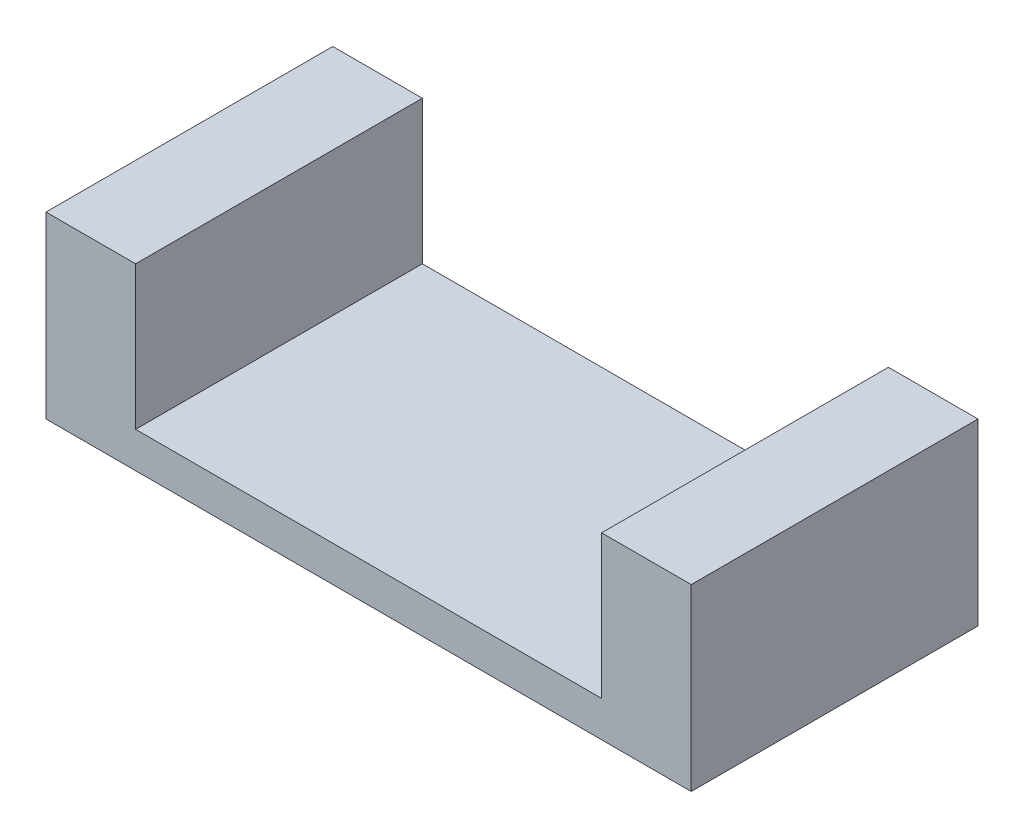
ISO-10303-21;
HEADER;
FILE_DESCRIPTION(('STEP AP214'),'2;1');
FILE_NAME('part.step','',(''),(''),'','','');
FILE_SCHEMA(('AUTOMOTIVE_DESIGN { 1 0 10303 214 1 1 1 1 }'));
ENDSEC;
DATA;
#1=APPLICATION_CONTEXT('core data for automotive mechanical design processes');
#2=APPLICATION_PROTOCOL_DEFINITION('international standard','automotive_design',2000,#1);
#3=PRODUCT_CONTEXT('',#1,'mechanical');
#4=PRODUCT('Part','Part','',(#3));
#5=PRODUCT_RELATED_PRODUCT_CATEGORY('part','',(#4));
#6=PRODUCT_DEFINITION_FORMATION('','',#4);
#7=PRODUCT_DEFINITION_CONTEXT('part definition',#1,'design');
#8=PRODUCT_DEFINITION('design','',#6,#7);
#9=PRODUCT_DEFINITION_SHAPE('','',#8);
#10=(LENGTH_UNIT() NAMED_UNIT(*) SI_UNIT(.MILLI.,.METRE.));
#11=(NAMED_UNIT(*) PLANE_ANGLE_UNIT() SI_UNIT($,.RADIAN.));
#12=(NAMED_UNIT(*) SI_UNIT($,.STERADIAN.) SOLID_ANGLE_UNIT());
#13=UNCERTAINTY_MEASURE_WITH_UNIT(LENGTH_MEASURE(1.E-05),#10,'distance_accuracy_value','');
#14=(GEOMETRIC_REPRESENTATION_CONTEXT(3) GLOBAL_UNCERTAINTY_ASSIGNED_CONTEXT((#13)) GLOBAL_UNIT_ASSIGNED_CONTEXT((#10,
#11,#12)) REPRESENTATION_CONTEXT('',''));
#15=CARTESIAN_POINT('',(0.,0.,0.));
#16=DIRECTION('',(0.,0.,1.));
#17=DIRECTION('',(1.,0.,0.));
#18=AXIS2_PLACEMENT_3D('',#15,#16,#17);
#19=CARTESIAN_POINT('',(0.,0.,0.8));
#20=DIRECTION('',(-1.,0.,0.));
#21=DIRECTION('',(0.,0.,1.));
#22=AXIS2_PLACEMENT_3D('',#19,#20,#21);
#23=PLANE('',#22);
#24=DIRECTION('',(0.,1.,0.));
#25=VECTOR('',#24,1.);
#26=CARTESIAN_POINT('',(0.,0.,0.));
#27=LINE('',#26,#25);
#28=CARTESIAN_POINT('',(0.,0.,0.));
#29=VERTEX_POINT('',#28);
#30=CARTESIAN_POINT('',(0.,0.5,0.));
#31=VERTEX_POINT('',#30);
#32=EDGE_CURVE('E140',#29,#31,#27,.T.);
#33=ORIENTED_EDGE('',*,*,#32,.T.);
#34=DIRECTION('',(0.,0.,-1.));
#35=VECTOR('',#34,1.);
#36=CARTESIAN_POINT('',(0.,0.5,0.8));
#37=LINE('',#36,#35);
#38=CARTESIAN_POINT('',(0.,0.5,0.8));
#39=VERTEX_POINT('',#38);
#40=EDGE_CURVE('E11',#39,#31,#37,.T.);
#41=ORIENTED_EDGE('',*,*,#40,.F.);
#42=DIRECTION('',(0.,1.,0.));
#43=VECTOR('',#42,1.);
#44=CARTESIAN_POINT('',(0.,0.,0.8));
#45=LINE('',#44,#43);
#46=CARTESIAN_POINT('',(0.,0.,0.8));
#47=VERTEX_POINT('',#46);
#48=EDGE_CURVE('E162',#47,#39,#45,.T.);
#49=ORIENTED_EDGE('',*,*,#48,.F.);
#50=DIRECTION('',(0.,0.,-1.));
#51=VECTOR('',#50,1.);
#52=CARTESIAN_POINT('',(0.,0.,0.8));
#53=LINE('',#52,#51);
#54=EDGE_CURVE('E136',#47,#29,#53,.T.);
#55=ORIENTED_EDGE('',*,*,#54,.T.);
#56=EDGE_LOOP('',(#33,#41,#49,#55));
#57=FACE_BOUND('',#56,.T.);
#58=ADVANCED_FACE('F39',(#57),#23,.F.);
#59=CARTESIAN_POINT('',(0.,0.5,0.8));
#60=DIRECTION('',(0.,-1.,0.));
#61=DIRECTION('',(0.,0.,-1.));
#62=AXIS2_PLACEMENT_3D('',#59,#60,#61);
#63=PLANE('',#62);
#64=DIRECTION('',(-1.,0.,0.));
#65=VECTOR('',#64,1.);
#66=CARTESIAN_POINT('',(0.,0.5,0.));
#67=LINE('',#66,#65);
#68=CARTESIAN_POINT('',(-0.25,0.5,0.));
#69=VERTEX_POINT('',#68);
#70=EDGE_CURVE('E144',#31,#69,#67,.T.);
#71=ORIENTED_EDGE('',*,*,#70,.T.);
#72=DIRECTION('',(0.,0.,-1.));
#73=VECTOR('',#72,1.);
#74=CARTESIAN_POINT('',(-0.25,0.5,0.8));
#75=LINE('',#74,#73);
#76=CARTESIAN_POINT('',(-0.25,0.5,0.8));
#77=VERTEX_POINT('',#76);
#78=EDGE_CURVE('E48',#77,#69,#75,.T.);
#79=ORIENTED_EDGE('',*,*,#78,.F.);
#80=DIRECTION('',(-1.,0.,0.));
#81=VECTOR('',#80,1.);
#82=CARTESIAN_POINT('',(0.,0.5,0.8));
#83=LINE('',#82,#81);
#84=EDGE_CURVE('E99',#39,#77,#83,.T.);
#85=ORIENTED_EDGE('',*,*,#84,.F.);
#86=ORIENTED_EDGE('',*,*,#40,.T.);
#87=EDGE_LOOP('',(#71,#79,#85,#86));
#88=FACE_BOUND('',#87,.T.);
#89=ADVANCED_FACE('F208',(#88),#63,.F.);
#90=CARTESIAN_POINT('',(-0.25,0.5,0.8));
#91=DIRECTION('',(1.,0.,0.));
#92=DIRECTION('',(0.,1.,0.));
#93=AXIS2_PLACEMENT_3D('',#90,#91,#92);
#94=PLANE('',#93);
#95=DIRECTION('',(0.,-1.,0.));
#96=VECTOR('',#95,1.);
#97=CARTESIAN_POINT('',(-0.25,0.5,0.));
#98=LINE('',#97,#96);
#99=CARTESIAN_POINT('',(-0.25,0.1,0.));
#100=VERTEX_POINT('',#99);
#101=EDGE_CURVE('E147',#69,#100,#98,.T.);
#102=ORIENTED_EDGE('',*,*,#101,.T.);
#103=DIRECTION('',(0.,0.,-1.));
#104=VECTOR('',#103,1.);
#105=CARTESIAN_POINT('',(-0.25,0.1,0.8));
#106=LINE('',#105,#104);
#107=CARTESIAN_POINT('',(-0.25,0.1,0.8));
#108=VERTEX_POINT('',#107);
#109=EDGE_CURVE('E173',#108,#100,#106,.T.);
#110=ORIENTED_EDGE('',*,*,#109,.F.);
#111=DIRECTION('',(0.,-1.,0.));
#112=VECTOR('',#111,1.);
#113=CARTESIAN_POINT('',(-0.25,0.5,0.8));
#114=LINE('',#113,#112);
#115=EDGE_CURVE('E183',#77,#108,#114,.T.);
#116=ORIENTED_EDGE('',*,*,#115,.F.);
#117=ORIENTED_EDGE('',*,*,#78,.T.);
#118=EDGE_LOOP('',(#102,#110,#116,#117));
#119=FACE_BOUND('',#118,.T.);
#120=ADVANCED_FACE('F181',(#119),#94,.F.);
#121=CARTESIAN_POINT('',(-0.25,0.1,0.8));
#122=DIRECTION('',(0.,-1.,0.));
#123=DIRECTION('',(1.,0.,0.));
#124=AXIS2_PLACEMENT_3D('',#121,#122,#123);
#125=PLANE('',#124);
#126=DIRECTION('',(-1.,0.,0.));
#127=VECTOR('',#126,1.);
#128=CARTESIAN_POINT('',(-0.25,0.1,0.));
#129=LINE('',#128,#127);
#130=CARTESIAN_POINT('',(-1.55,0.0999999999999998,0.));
#131=VERTEX_POINT('',#130);
#132=EDGE_CURVE('E150',#100,#131,#129,.T.);
#133=ORIENTED_EDGE('',*,*,#132,.T.);
#134=DIRECTION('',(0.,0.,-1.));
#135=VECTOR('',#134,1.);
#136=CARTESIAN_POINT('',(-1.55,0.0999999999999998,0.8));
#137=LINE('',#136,#135);
#138=CARTESIAN_POINT('',(-1.55,0.0999999999999998,0.8));
#139=VERTEX_POINT('',#138);
#140=EDGE_CURVE('E169',#139,#131,#137,.T.);
#141=ORIENTED_EDGE('',*,*,#140,.F.);
#142=DIRECTION('',(-1.,0.,0.));
#143=VECTOR('',#142,1.);
#144=CARTESIAN_POINT('',(-0.25,0.1,0.8));
#145=LINE('',#144,#143);
#146=EDGE_CURVE('E196',#108,#139,#145,.T.);
#147=ORIENTED_EDGE('',*,*,#146,.F.);
#148=ORIENTED_EDGE('',*,*,#109,.T.);
#149=EDGE_LOOP('',(#133,#141,#147,#148));
#150=FACE_BOUND('',#149,.T.);
#151=ADVANCED_FACE('F191',(#150),#125,.F.);
#152=CARTESIAN_POINT('',(-1.55,0.5,0.8));
#153=DIRECTION('',(-1.,0.,0.));
#154=DIRECTION('',(0.,0.,1.));
#155=AXIS2_PLACEMENT_3D('',#152,#153,#154);
#156=PLANE('',#155);
#157=DIRECTION('',(0.,1.,0.));
#158=VECTOR('',#157,1.);
#159=CARTESIAN_POINT('',(-1.55,0.5,0.));
#160=LINE('',#159,#158);
#161=CARTESIAN_POINT('',(-1.55,0.5,0.));
#162=VERTEX_POINT('',#161);
#163=EDGE_CURVE('E153',#131,#162,#160,.T.);
#164=ORIENTED_EDGE('',*,*,#163,.T.);
#165=DIRECTION('',(0.,0.,-1.));
#166=VECTOR('',#165,1.);
#167=CARTESIAN_POINT('',(-1.55,0.5,0.8));
#168=LINE('',#167,#166);
#169=CARTESIAN_POINT('',(-1.55,0.5,0.8));
#170=VERTEX_POINT('',#169);
#171=EDGE_CURVE('E129',#170,#162,#168,.T.);
#172=ORIENTED_EDGE('',*,*,#171,.F.);
#173=DIRECTION('',(0.,1.,0.));
#174=VECTOR('',#173,1.);
#175=CARTESIAN_POINT('',(-1.55,0.5,0.8));
#176=LINE('',#175,#174);
#177=EDGE_CURVE('E118',#139,#170,#176,.T.);
#178=ORIENTED_EDGE('',*,*,#177,.F.);
#179=ORIENTED_EDGE('',*,*,#140,.T.);
#180=EDGE_LOOP('',(#164,#172,#178,#179));
#181=FACE_BOUND('',#180,.T.);
#182=ADVANCED_FACE('F194',(#181),#156,.F.);
#183=CARTESIAN_POINT('',(-1.8,0.5,0.8));
#184=DIRECTION('',(0.,-1.,0.));
#185=DIRECTION('',(0.,0.,-1.));
#186=AXIS2_PLACEMENT_3D('',#183,#184,#185);
#187=PLANE('',#186);
#188=DIRECTION('',(-1.,0.,0.));
#189=VECTOR('',#188,1.);
#190=CARTESIAN_POINT('',(-1.8,0.5,0.));
#191=LINE('',#190,#189);
#192=CARTESIAN_POINT('',(-1.8,0.5,0.));
#193=VERTEX_POINT('',#192);
#194=EDGE_CURVE('E127',#162,#193,#191,.T.);
#195=ORIENTED_EDGE('',*,*,#194,.T.);
#196=DIRECTION('',(0.,0.,-1.));
#197=VECTOR('',#196,1.);
#198=CARTESIAN_POINT('',(-1.8,0.5,0.8));
#199=LINE('',#198,#197);
#200=CARTESIAN_POINT('',(-1.8,0.5,0.8));
#201=VERTEX_POINT('',#200);
#202=EDGE_CURVE('E124',#201,#193,#199,.T.);
#203=ORIENTED_EDGE('',*,*,#202,.F.);
#204=DIRECTION('',(-1.,0.,0.));
#205=VECTOR('',#204,1.);
#206=CARTESIAN_POINT('',(-1.8,0.5,0.8));
#207=LINE('',#206,#205);
#208=EDGE_CURVE('E112',#170,#201,#207,.T.);
#209=ORIENTED_EDGE('',*,*,#208,.F.);
#210=ORIENTED_EDGE('',*,*,#171,.T.);
#211=EDGE_LOOP('',(#195,#203,#209,#210));
#212=FACE_BOUND('',#211,.T.);
#213=ADVANCED_FACE('F125',(#212),#187,.F.);
#214=CARTESIAN_POINT('',(-1.8,0.,0.8));
#215=DIRECTION('',(1.,0.,0.));
#216=DIRECTION('',(0.,1.,0.));
#217=AXIS2_PLACEMENT_3D('',#214,#215,#216);
#218=PLANE('',#217);
#219=DIRECTION('',(0.,-1.,0.));
#220=VECTOR('',#219,1.);
#221=CARTESIAN_POINT('',(-1.8,0.,0.));
#222=LINE('',#221,#220);
#223=CARTESIAN_POINT('',(-1.8,0.,0.));
#224=VERTEX_POINT('',#223);
#225=EDGE_CURVE('E85',#193,#224,#222,.T.);
#226=ORIENTED_EDGE('',*,*,#225,.T.);
#227=DIRECTION('',(0.,0.,-1.));
#228=VECTOR('',#227,1.);
#229=CARTESIAN_POINT('',(-1.8,0.,0.8));
#230=LINE('',#229,#228);
#231=CARTESIAN_POINT('',(-1.8,0.,0.8));
#232=VERTEX_POINT('',#231);
#233=EDGE_CURVE('E130',#232,#224,#230,.T.);
#234=ORIENTED_EDGE('',*,*,#233,.F.);
#235=DIRECTION('',(0.,-1.,0.));
#236=VECTOR('',#235,1.);
#237=CARTESIAN_POINT('',(-1.8,0.,0.8));
#238=LINE('',#237,#236);
#239=EDGE_CURVE('E116',#201,#232,#238,.T.);
#240=ORIENTED_EDGE('',*,*,#239,.F.);
#241=ORIENTED_EDGE('',*,*,#202,.T.);
#242=EDGE_LOOP('',(#226,#234,#240,#241));
#243=FACE_BOUND('',#242,.T.);
#244=ADVANCED_FACE('F132',(#243),#218,.F.);
#245=CARTESIAN_POINT('',(0.,0.,0.8));
#246=DIRECTION('',(0.,1.,0.));
#247=DIRECTION('',(-1.,0.,0.));
#248=AXIS2_PLACEMENT_3D('',#245,#246,#247);
#249=PLANE('',#248);
#250=DIRECTION('',(1.,0.,0.));
#251=VECTOR('',#250,1.);
#252=CARTESIAN_POINT('',(0.,0.,0.));
#253=LINE('',#252,#251);
#254=EDGE_CURVE('E91',#224,#29,#253,.T.);
#255=ORIENTED_EDGE('',*,*,#254,.T.);
#256=ORIENTED_EDGE('',*,*,#54,.F.);
#257=DIRECTION('',(1.,0.,0.));
#258=VECTOR('',#257,1.);
#259=CARTESIAN_POINT('',(0.,0.,0.8));
#260=LINE('',#259,#258);
#261=EDGE_CURVE('E56',#232,#47,#260,.T.);
#262=ORIENTED_EDGE('',*,*,#261,.F.);
#263=ORIENTED_EDGE('',*,*,#233,.T.);
#264=EDGE_LOOP('',(#255,#256,#262,#263));
#265=FACE_BOUND('',#264,.T.);
#266=ADVANCED_FACE('F224',(#265),#249,.F.);
#267=CARTESIAN_POINT('',(0.,0.,0.8));
#268=DIRECTION('',(0.,0.,1.));
#269=DIRECTION('',(1.,0.,0.));
#270=AXIS2_PLACEMENT_3D('',#267,#268,#269);
#271=PLANE('',#270);
#272=ORIENTED_EDGE('',*,*,#48,.T.);
#273=ORIENTED_EDGE('',*,*,#84,.T.);
#274=ORIENTED_EDGE('',*,*,#115,.T.);
#275=ORIENTED_EDGE('',*,*,#146,.T.);
#276=ORIENTED_EDGE('',*,*,#177,.T.);
#277=ORIENTED_EDGE('',*,*,#208,.T.);
#278=ORIENTED_EDGE('',*,*,#239,.T.);
#279=ORIENTED_EDGE('',*,*,#261,.T.);
#280=EDGE_LOOP('',(#272,#273,#274,#275,#276,#277,#278,#279));
#281=FACE_BOUND('',#280,.T.);
#282=ADVANCED_FACE('F114',(#281),#271,.T.);
#283=CARTESIAN_POINT('',(0.,0.,0.));
#284=DIRECTION('',(0.,0.,1.));
#285=DIRECTION('',(1.,0.,0.));
#286=AXIS2_PLACEMENT_3D('',#283,#284,#285);
#287=PLANE('',#286);
#288=ORIENTED_EDGE('',*,*,#32,.F.);
#289=ORIENTED_EDGE('',*,*,#254,.F.);
#290=ORIENTED_EDGE('',*,*,#225,.F.);
#291=ORIENTED_EDGE('',*,*,#194,.F.);
#292=ORIENTED_EDGE('',*,*,#163,.F.);
#293=ORIENTED_EDGE('',*,*,#132,.F.);
#294=ORIENTED_EDGE('',*,*,#101,.F.);
#295=ORIENTED_EDGE('',*,*,#70,.F.);
#296=EDGE_LOOP('',(#288,#289,#290,#291,#292,#293,#294,#295));
#297=FACE_BOUND('',#296,.T.);
#298=ADVANCED_FACE('F187',(#297),#287,.F.);
#299=CLOSED_SHELL('',(#58,#89,#120,#151,#182,#213,#244,#266,#282,#298));
#300=MANIFOLD_SOLID_BREP('B2',#299);
#301=ADVANCED_BREP_SHAPE_REPRESENTATION('',(#18,#300),#14);
#302=SHAPE_DEFINITION_REPRESENTATION(#9,#301);
ENDSEC;
END-ISO-10303-21;
